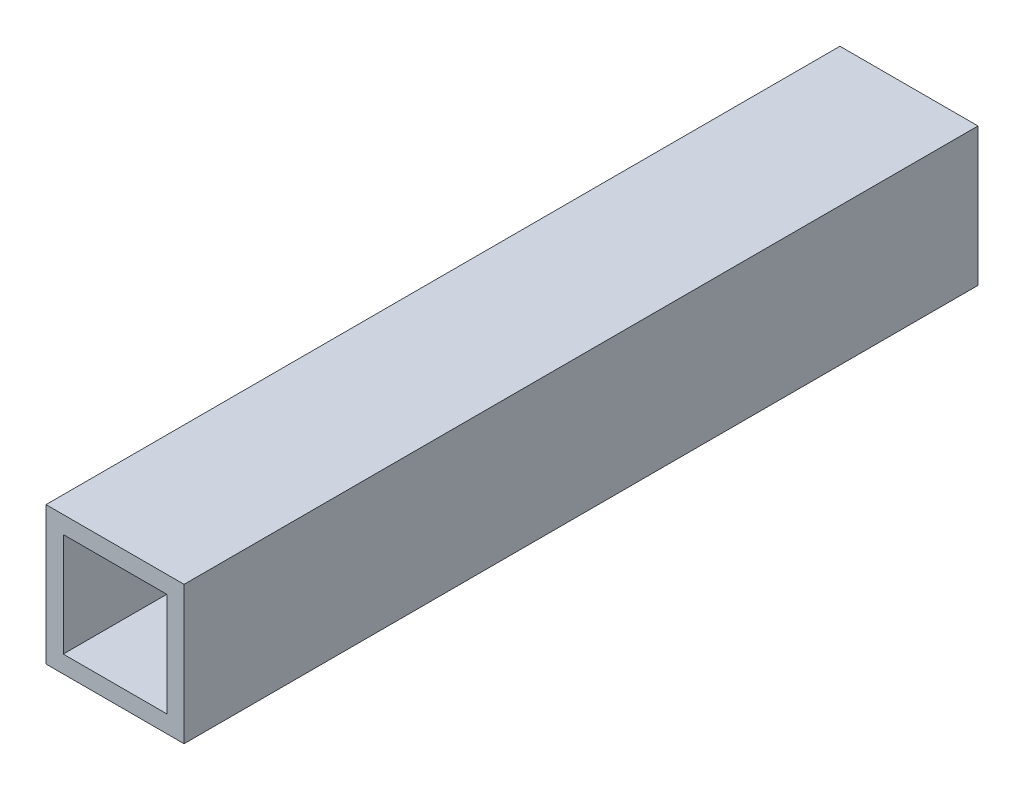
ISO-10303-21;
HEADER;
FILE_DESCRIPTION(('STEP AP214'),'2;1');
FILE_NAME('part.step','',(''),(''),'','','');
FILE_SCHEMA(('AUTOMOTIVE_DESIGN { 1 0 10303 214 1 1 1 1 }'));
ENDSEC;
DATA;
#1=APPLICATION_CONTEXT('core data for automotive mechanical design processes');
#2=APPLICATION_PROTOCOL_DEFINITION('international standard','automotive_design',2000,#1);
#3=PRODUCT_CONTEXT('',#1,'mechanical');
#4=PRODUCT('Part','Part','',(#3));
#5=PRODUCT_RELATED_PRODUCT_CATEGORY('part','',(#4));
#6=PRODUCT_DEFINITION_FORMATION('','',#4);
#7=PRODUCT_DEFINITION_CONTEXT('part definition',#1,'design');
#8=PRODUCT_DEFINITION('design','',#6,#7);
#9=PRODUCT_DEFINITION_SHAPE('','',#8);
#10=(LENGTH_UNIT() NAMED_UNIT(*) SI_UNIT(.MILLI.,.METRE.));
#11=(NAMED_UNIT(*) PLANE_ANGLE_UNIT() SI_UNIT($,.RADIAN.));
#12=(NAMED_UNIT(*) SI_UNIT($,.STERADIAN.) SOLID_ANGLE_UNIT());
#13=UNCERTAINTY_MEASURE_WITH_UNIT(LENGTH_MEASURE(1.E-05),#10,'distance_accuracy_value','');
#14=(GEOMETRIC_REPRESENTATION_CONTEXT(3) GLOBAL_UNCERTAINTY_ASSIGNED_CONTEXT((#13)) GLOBAL_UNIT_ASSIGNED_CONTEXT((#10,
#11,#12)) REPRESENTATION_CONTEXT('',''));
#15=CARTESIAN_POINT('',(0.,0.,0.));
#16=DIRECTION('',(0.,0.,1.));
#17=DIRECTION('',(1.,0.,0.));
#18=AXIS2_PLACEMENT_3D('',#15,#16,#17);
#19=CARTESIAN_POINT('',(0.,0.,230.));
#20=DIRECTION('',(0.,0.,1.));
#21=DIRECTION('',(1.,0.,0.));
#22=AXIS2_PLACEMENT_3D('',#19,#20,#21);
#23=PLANE('',#22);
#24=DIRECTION('',(0.,-1.,0.));
#25=VECTOR('',#24,1.);
#26=CARTESIAN_POINT('',(-20.,20.,230.));
#27=LINE('',#26,#25);
#28=CARTESIAN_POINT('',(-20.,20.,230.));
#29=VERTEX_POINT('',#28);
#30=CARTESIAN_POINT('',(-20.,-20.,230.));
#31=VERTEX_POINT('',#30);
#32=EDGE_CURVE('E153',#29,#31,#27,.T.);
#33=ORIENTED_EDGE('',*,*,#32,.T.);
#34=DIRECTION('',(1.,0.,0.));
#35=VECTOR('',#34,1.);
#36=CARTESIAN_POINT('',(-20.,-20.,230.));
#37=LINE('',#36,#35);
#38=CARTESIAN_POINT('',(20.,-20.,230.));
#39=VERTEX_POINT('',#38);
#40=EDGE_CURVE('E157',#31,#39,#37,.T.);
#41=ORIENTED_EDGE('',*,*,#40,.T.);
#42=DIRECTION('',(0.,1.,0.));
#43=VECTOR('',#42,1.);
#44=CARTESIAN_POINT('',(20.,20.,230.));
#45=LINE('',#44,#43);
#46=CARTESIAN_POINT('',(20.,20.,230.));
#47=VERTEX_POINT('',#46);
#48=EDGE_CURVE('E161',#39,#47,#45,.T.);
#49=ORIENTED_EDGE('',*,*,#48,.T.);
#50=DIRECTION('',(-1.,0.,0.));
#51=VECTOR('',#50,1.);
#52=CARTESIAN_POINT('',(-20.,20.,230.));
#53=LINE('',#52,#51);
#54=EDGE_CURVE('E164',#47,#29,#53,.T.);
#55=ORIENTED_EDGE('',*,*,#54,.T.);
#56=EDGE_LOOP('',(#33,#41,#49,#55));
#57=FACE_BOUND('',#56,.T.);
#58=DIRECTION('',(-1.,0.,0.));
#59=VECTOR('',#58,1.);
#60=CARTESIAN_POINT('',(-15.,15.,230.));
#61=LINE('',#60,#59);
#62=CARTESIAN_POINT('',(15.,15.,230.));
#63=VERTEX_POINT('',#62);
#64=CARTESIAN_POINT('',(-15.,15.,230.));
#65=VERTEX_POINT('',#64);
#66=EDGE_CURVE('E114',#63,#65,#61,.T.);
#67=ORIENTED_EDGE('',*,*,#66,.F.);
#68=DIRECTION('',(0.,1.,0.));
#69=VECTOR('',#68,1.);
#70=CARTESIAN_POINT('',(15.,15.,230.));
#71=LINE('',#70,#69);
#72=CARTESIAN_POINT('',(15.,-15.,230.));
#73=VERTEX_POINT('',#72);
#74=EDGE_CURVE('E105',#73,#63,#71,.T.);
#75=ORIENTED_EDGE('',*,*,#74,.F.);
#76=DIRECTION('',(1.,0.,0.));
#77=VECTOR('',#76,1.);
#78=CARTESIAN_POINT('',(-15.,-15.,230.));
#79=LINE('',#78,#77);
#80=CARTESIAN_POINT('',(-15.,-15.,230.));
#81=VERTEX_POINT('',#80);
#82=EDGE_CURVE('E131',#81,#73,#79,.T.);
#83=ORIENTED_EDGE('',*,*,#82,.F.);
#84=DIRECTION('',(0.,-1.,0.));
#85=VECTOR('',#84,1.);
#86=CARTESIAN_POINT('',(-15.,15.,230.));
#87=LINE('',#86,#85);
#88=EDGE_CURVE('E127',#65,#81,#87,.T.);
#89=ORIENTED_EDGE('',*,*,#88,.F.);
#90=EDGE_LOOP('',(#67,#75,#83,#89));
#91=FACE_BOUND('',#90,.T.);
#92=ADVANCED_FACE('F39',(#57,#91),#23,.T.);
#93=CARTESIAN_POINT('',(0.,0.,0.));
#94=DIRECTION('',(0.,0.,1.));
#95=DIRECTION('',(1.,0.,0.));
#96=AXIS2_PLACEMENT_3D('',#93,#94,#95);
#97=PLANE('',#96);
#98=DIRECTION('',(0.,-1.,0.));
#99=VECTOR('',#98,1.);
#100=CARTESIAN_POINT('',(-20.,20.,0.));
#101=LINE('',#100,#99);
#102=CARTESIAN_POINT('',(-20.,20.,0.));
#103=VERTEX_POINT('',#102);
#104=CARTESIAN_POINT('',(-20.,-20.,0.));
#105=VERTEX_POINT('',#104);
#106=EDGE_CURVE('E123',#103,#105,#101,.T.);
#107=ORIENTED_EDGE('',*,*,#106,.F.);
#108=DIRECTION('',(-1.,0.,0.));
#109=VECTOR('',#108,1.);
#110=CARTESIAN_POINT('',(-20.,20.,0.));
#111=LINE('',#110,#109);
#112=CARTESIAN_POINT('',(20.,20.,0.));
#113=VERTEX_POINT('',#112);
#114=EDGE_CURVE('E158',#113,#103,#111,.T.);
#115=ORIENTED_EDGE('',*,*,#114,.F.);
#116=DIRECTION('',(0.,1.,0.));
#117=VECTOR('',#116,1.);
#118=CARTESIAN_POINT('',(20.,20.,0.));
#119=LINE('',#118,#117);
#120=CARTESIAN_POINT('',(20.,-20.,0.));
#121=VERTEX_POINT('',#120);
#122=EDGE_CURVE('E174',#121,#113,#119,.T.);
#123=ORIENTED_EDGE('',*,*,#122,.F.);
#124=DIRECTION('',(1.,0.,0.));
#125=VECTOR('',#124,1.);
#126=CARTESIAN_POINT('',(-20.,-20.,0.));
#127=LINE('',#126,#125);
#128=EDGE_CURVE('E171',#105,#121,#127,.T.);
#129=ORIENTED_EDGE('',*,*,#128,.F.);
#130=EDGE_LOOP('',(#107,#115,#123,#129));
#131=FACE_BOUND('',#130,.T.);
#132=DIRECTION('',(0.,1.,0.));
#133=VECTOR('',#132,1.);
#134=CARTESIAN_POINT('',(15.,15.,0.));
#135=LINE('',#134,#133);
#136=CARTESIAN_POINT('',(15.,-15.,0.));
#137=VERTEX_POINT('',#136);
#138=CARTESIAN_POINT('',(15.,15.,0.));
#139=VERTEX_POINT('',#138);
#140=EDGE_CURVE('E63',#137,#139,#135,.T.);
#141=ORIENTED_EDGE('',*,*,#140,.T.);
#142=DIRECTION('',(-1.,0.,0.));
#143=VECTOR('',#142,1.);
#144=CARTESIAN_POINT('',(-15.,15.,0.));
#145=LINE('',#144,#143);
#146=CARTESIAN_POINT('',(-15.,15.,0.));
#147=VERTEX_POINT('',#146);
#148=EDGE_CURVE('E121',#139,#147,#145,.T.);
#149=ORIENTED_EDGE('',*,*,#148,.T.);
#150=DIRECTION('',(0.,-1.,0.));
#151=VECTOR('',#150,1.);
#152=CARTESIAN_POINT('',(-15.,15.,0.));
#153=LINE('',#152,#151);
#154=CARTESIAN_POINT('',(-15.,-15.,0.));
#155=VERTEX_POINT('',#154);
#156=EDGE_CURVE('E140',#147,#155,#153,.T.);
#157=ORIENTED_EDGE('',*,*,#156,.T.);
#158=DIRECTION('',(1.,0.,0.));
#159=VECTOR('',#158,1.);
#160=CARTESIAN_POINT('',(-15.,-15.,0.));
#161=LINE('',#160,#159);
#162=EDGE_CURVE('E115',#155,#137,#161,.T.);
#163=ORIENTED_EDGE('',*,*,#162,.T.);
#164=EDGE_LOOP('',(#141,#149,#157,#163));
#165=FACE_BOUND('',#164,.T.);
#166=ADVANCED_FACE('F197',(#131,#165),#97,.F.);
#167=CARTESIAN_POINT('',(-20.,20.,230.));
#168=DIRECTION('',(1.,0.,0.));
#169=DIRECTION('',(0.,1.,0.));
#170=AXIS2_PLACEMENT_3D('',#167,#168,#169);
#171=PLANE('',#170);
#172=ORIENTED_EDGE('',*,*,#106,.T.);
#173=DIRECTION('',(0.,0.,-1.));
#174=VECTOR('',#173,1.);
#175=CARTESIAN_POINT('',(-20.,-20.,230.));
#176=LINE('',#175,#174);
#177=EDGE_CURVE('E11',#31,#105,#176,.T.);
#178=ORIENTED_EDGE('',*,*,#177,.F.);
#179=ORIENTED_EDGE('',*,*,#32,.F.);
#180=DIRECTION('',(0.,0.,-1.));
#181=VECTOR('',#180,1.);
#182=CARTESIAN_POINT('',(-20.,20.,230.));
#183=LINE('',#182,#181);
#184=EDGE_CURVE('E167',#29,#103,#183,.T.);
#185=ORIENTED_EDGE('',*,*,#184,.T.);
#186=EDGE_LOOP('',(#172,#178,#179,#185));
#187=FACE_BOUND('',#186,.T.);
#188=ADVANCED_FACE('F41',(#187),#171,.F.);
#189=CARTESIAN_POINT('',(-20.,-20.,230.));
#190=DIRECTION('',(0.,1.,0.));
#191=DIRECTION('',(-1.,0.,0.));
#192=AXIS2_PLACEMENT_3D('',#189,#190,#191);
#193=PLANE('',#192);
#194=ORIENTED_EDGE('',*,*,#128,.T.);
#195=DIRECTION('',(0.,0.,-1.));
#196=VECTOR('',#195,1.);
#197=CARTESIAN_POINT('',(20.,-20.,230.));
#198=LINE('',#197,#196);
#199=EDGE_CURVE('E48',#39,#121,#198,.T.);
#200=ORIENTED_EDGE('',*,*,#199,.F.);
#201=ORIENTED_EDGE('',*,*,#40,.F.);
#202=ORIENTED_EDGE('',*,*,#177,.T.);
#203=EDGE_LOOP('',(#194,#200,#201,#202));
#204=FACE_BOUND('',#203,.T.);
#205=ADVANCED_FACE('F207',(#204),#193,.F.);
#206=CARTESIAN_POINT('',(20.,20.,230.));
#207=DIRECTION('',(-1.,0.,0.));
#208=DIRECTION('',(0.,-1.,0.));
#209=AXIS2_PLACEMENT_3D('',#206,#207,#208);
#210=PLANE('',#209);
#211=ORIENTED_EDGE('',*,*,#122,.T.);
#212=DIRECTION('',(0.,0.,-1.));
#213=VECTOR('',#212,1.);
#214=CARTESIAN_POINT('',(20.,20.,230.));
#215=LINE('',#214,#213);
#216=EDGE_CURVE('E182',#47,#113,#215,.T.);
#217=ORIENTED_EDGE('',*,*,#216,.F.);
#218=ORIENTED_EDGE('',*,*,#48,.F.);
#219=ORIENTED_EDGE('',*,*,#199,.T.);
#220=EDGE_LOOP('',(#211,#217,#218,#219));
#221=FACE_BOUND('',#220,.T.);
#222=ADVANCED_FACE('F191',(#221),#210,.F.);
#223=CARTESIAN_POINT('',(-20.,20.,230.));
#224=DIRECTION('',(0.,-1.,0.));
#225=DIRECTION('',(0.,0.,-1.));
#226=AXIS2_PLACEMENT_3D('',#223,#224,#225);
#227=PLANE('',#226);
#228=ORIENTED_EDGE('',*,*,#114,.T.);
#229=ORIENTED_EDGE('',*,*,#184,.F.);
#230=ORIENTED_EDGE('',*,*,#54,.F.);
#231=ORIENTED_EDGE('',*,*,#216,.T.);
#232=EDGE_LOOP('',(#228,#229,#230,#231));
#233=FACE_BOUND('',#232,.T.);
#234=ADVANCED_FACE('F201',(#233),#227,.F.);
#235=CARTESIAN_POINT('',(15.,15.,230.));
#236=DIRECTION('',(-1.,0.,0.));
#237=DIRECTION('',(0.,-1.,0.));
#238=AXIS2_PLACEMENT_3D('',#235,#236,#237);
#239=PLANE('',#238);
#240=ORIENTED_EDGE('',*,*,#140,.F.);
#241=DIRECTION('',(0.,0.,-1.));
#242=VECTOR('',#241,1.);
#243=CARTESIAN_POINT('',(15.,-15.,230.));
#244=LINE('',#243,#242);
#245=EDGE_CURVE('E109',#73,#137,#244,.T.);
#246=ORIENTED_EDGE('',*,*,#245,.F.);
#247=ORIENTED_EDGE('',*,*,#74,.T.);
#248=DIRECTION('',(0.,0.,-1.));
#249=VECTOR('',#248,1.);
#250=CARTESIAN_POINT('',(15.,15.,230.));
#251=LINE('',#250,#249);
#252=EDGE_CURVE('E108',#63,#139,#251,.T.);
#253=ORIENTED_EDGE('',*,*,#252,.T.);
#254=EDGE_LOOP('',(#240,#246,#247,#253));
#255=FACE_BOUND('',#254,.T.);
#256=ADVANCED_FACE('F107',(#255),#239,.T.);
#257=CARTESIAN_POINT('',(-15.,15.,230.));
#258=DIRECTION('',(0.,-1.,0.));
#259=DIRECTION('',(0.,0.,-1.));
#260=AXIS2_PLACEMENT_3D('',#257,#258,#259);
#261=PLANE('',#260);
#262=ORIENTED_EDGE('',*,*,#148,.F.);
#263=ORIENTED_EDGE('',*,*,#252,.F.);
#264=ORIENTED_EDGE('',*,*,#66,.T.);
#265=DIRECTION('',(0.,0.,-1.));
#266=VECTOR('',#265,1.);
#267=CARTESIAN_POINT('',(-15.,15.,230.));
#268=LINE('',#267,#266);
#269=EDGE_CURVE('E124',#65,#147,#268,.T.);
#270=ORIENTED_EDGE('',*,*,#269,.T.);
#271=EDGE_LOOP('',(#262,#263,#264,#270));
#272=FACE_BOUND('',#271,.T.);
#273=ADVANCED_FACE('F118',(#272),#261,.T.);
#274=CARTESIAN_POINT('',(-15.,15.,230.));
#275=DIRECTION('',(1.,0.,0.));
#276=DIRECTION('',(0.,1.,0.));
#277=AXIS2_PLACEMENT_3D('',#274,#275,#276);
#278=PLANE('',#277);
#279=ORIENTED_EDGE('',*,*,#156,.F.);
#280=ORIENTED_EDGE('',*,*,#269,.F.);
#281=ORIENTED_EDGE('',*,*,#88,.T.);
#282=DIRECTION('',(0.,0.,-1.));
#283=VECTOR('',#282,1.);
#284=CARTESIAN_POINT('',(-15.,-15.,230.));
#285=LINE('',#284,#283);
#286=EDGE_CURVE('E55',#81,#155,#285,.T.);
#287=ORIENTED_EDGE('',*,*,#286,.T.);
#288=EDGE_LOOP('',(#279,#280,#281,#287));
#289=FACE_BOUND('',#288,.T.);
#290=ADVANCED_FACE('F230',(#289),#278,.T.);
#291=CARTESIAN_POINT('',(-15.,-15.,230.));
#292=DIRECTION('',(0.,1.,0.));
#293=DIRECTION('',(0.,0.,1.));
#294=AXIS2_PLACEMENT_3D('',#291,#292,#293);
#295=PLANE('',#294);
#296=ORIENTED_EDGE('',*,*,#162,.F.);
#297=ORIENTED_EDGE('',*,*,#286,.F.);
#298=ORIENTED_EDGE('',*,*,#82,.T.);
#299=ORIENTED_EDGE('',*,*,#245,.T.);
#300=EDGE_LOOP('',(#296,#297,#298,#299));
#301=FACE_BOUND('',#300,.T.);
#302=ADVANCED_FACE('F234',(#301),#295,.T.);
#303=CLOSED_SHELL('',(#92,#166,#188,#205,#222,#234,#256,#273,#290,#302));
#304=MANIFOLD_SOLID_BREP('B2',#303);
#305=ADVANCED_BREP_SHAPE_REPRESENTATION('',(#18,#304),#14);
#306=SHAPE_DEFINITION_REPRESENTATION(#9,#305);
ENDSEC;
END-ISO-10303-21;
